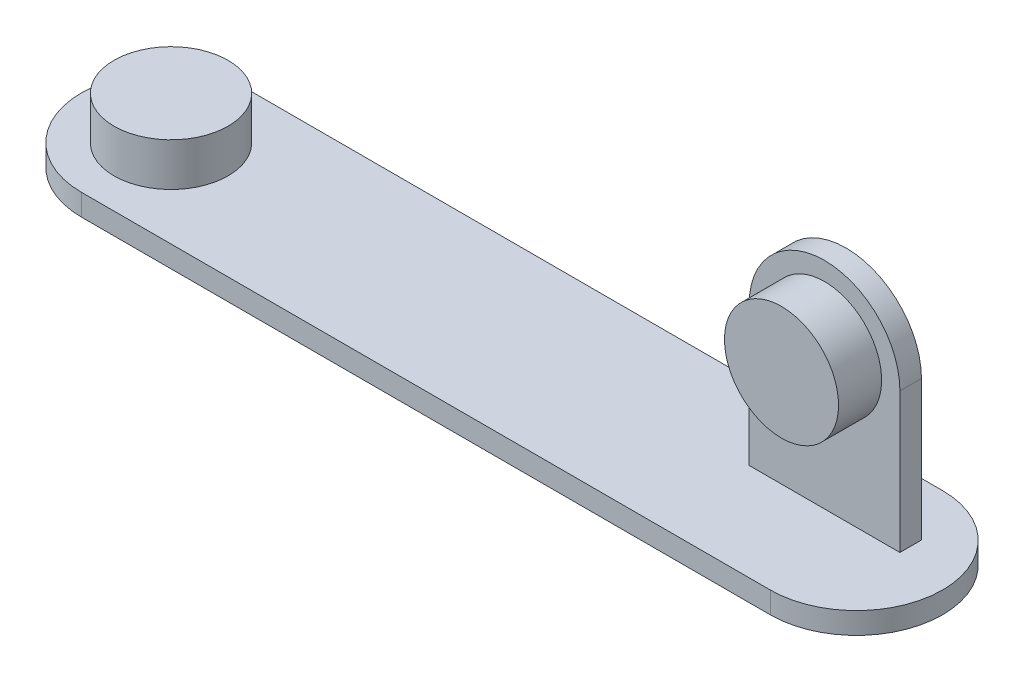
ISO-10303-21;
HEADER;
FILE_DESCRIPTION(('STEP AP214'),'2;1');
FILE_NAME('part.step','',(''),(''),'','','');
FILE_SCHEMA(('AUTOMOTIVE_DESIGN { 1 0 10303 214 1 1 1 1 }'));
ENDSEC;
DATA;
#1=APPLICATION_CONTEXT('core data for automotive mechanical design processes');
#2=APPLICATION_PROTOCOL_DEFINITION('international standard','automotive_design',2000,#1);
#3=PRODUCT_CONTEXT('',#1,'mechanical');
#4=PRODUCT('Part','Part','',(#3));
#5=PRODUCT_RELATED_PRODUCT_CATEGORY('part','',(#4));
#6=PRODUCT_DEFINITION_FORMATION('','',#4);
#7=PRODUCT_DEFINITION_CONTEXT('part definition',#1,'design');
#8=PRODUCT_DEFINITION('design','',#6,#7);
#9=PRODUCT_DEFINITION_SHAPE('','',#8);
#10=(LENGTH_UNIT() NAMED_UNIT(*) SI_UNIT(.MILLI.,.METRE.));
#11=(NAMED_UNIT(*) PLANE_ANGLE_UNIT() SI_UNIT($,.RADIAN.));
#12=(NAMED_UNIT(*) SI_UNIT($,.STERADIAN.) SOLID_ANGLE_UNIT());
#13=UNCERTAINTY_MEASURE_WITH_UNIT(LENGTH_MEASURE(1.E-05),#10,'distance_accuracy_value','');
#14=(GEOMETRIC_REPRESENTATION_CONTEXT(3) GLOBAL_UNCERTAINTY_ASSIGNED_CONTEXT((#13)) GLOBAL_UNIT_ASSIGNED_CONTEXT((#10,
#11,#12)) REPRESENTATION_CONTEXT('',''));
#15=CARTESIAN_POINT('',(0.,0.,0.));
#16=DIRECTION('',(0.,0.,1.));
#17=DIRECTION('',(1.,0.,0.));
#18=AXIS2_PLACEMENT_3D('',#15,#16,#17);
#19=CARTESIAN_POINT('',(-5.99999999999999,7.5,-5.51919935668366));
#20=DIRECTION('',(0.,0.,-1.));
#21=DIRECTION('',(-1.,0.,0.));
#22=AXIS2_PLACEMENT_3D('',#19,#20,#21);
#23=CYLINDRICAL_SURFACE('',#22,3.5);
#24=DIRECTION('',(0.,0.,1.));
#25=VECTOR('',#24,1.);
#26=CARTESIAN_POINT('',(-2.49999999999999,7.5,-5.51919935668366));
#27=LINE('',#26,#25);
#28=CARTESIAN_POINT('',(-2.49999999999999,7.5,-5.51919935668366));
#29=VERTEX_POINT('',#28);
#30=CARTESIAN_POINT('',(-2.49999999999999,7.5,-4.51919935668366));
#31=VERTEX_POINT('',#30);
#32=EDGE_CURVE('E167',#29,#31,#27,.T.);
#33=ORIENTED_EDGE('',*,*,#32,.F.);
#34=CARTESIAN_POINT('',(-5.99999999999999,7.5,-5.51919935668366));
#35=DIRECTION('',(0.,0.,1.));
#36=DIRECTION('',(1.,0.,0.));
#37=AXIS2_PLACEMENT_3D('',#34,#35,#36);
#38=CIRCLE('',#37,3.5);
#39=CARTESIAN_POINT('',(-9.49999999999999,7.5,-5.51919935668366));
#40=VERTEX_POINT('',#39);
#41=EDGE_CURVE('E50',#40,#29,#38,.F.);
#42=ORIENTED_EDGE('',*,*,#41,.F.);
#43=DIRECTION('',(0.,0.,1.));
#44=VECTOR('',#43,1.);
#45=CARTESIAN_POINT('',(-9.49999999999999,7.5,-5.51919935668366));
#46=LINE('',#45,#44);
#47=CARTESIAN_POINT('',(-9.49999999999999,7.5,-4.51919935668366));
#48=VERTEX_POINT('',#47);
#49=EDGE_CURVE('E170',#48,#40,#46,.F.);
#50=ORIENTED_EDGE('',*,*,#49,.F.);
#51=CARTESIAN_POINT('',(-5.99999999999999,7.5,-4.51919935668366));
#52=DIRECTION('',(0.,0.,-1.));
#53=DIRECTION('',(-1.,0.,0.));
#54=AXIS2_PLACEMENT_3D('',#51,#52,#53);
#55=CIRCLE('',#54,3.5);
#56=EDGE_CURVE('E43',#31,#48,#55,.F.);
#57=ORIENTED_EDGE('',*,*,#56,.F.);
#58=EDGE_LOOP('',(#33,#42,#50,#57));
#59=FACE_BOUND('',#58,.T.);
#60=ADVANCED_FACE('F35',(#59),#23,.T.);
#61=CARTESIAN_POINT('',(0.,1.,0.));
#62=DIRECTION('',(0.,1.,0.));
#63=DIRECTION('',(0.,0.,1.));
#64=AXIS2_PLACEMENT_3D('',#61,#62,#63);
#65=PLANE('',#64);
#66=CARTESIAN_POINT('',(-35.9030675856928,1.,-4.06518668938816));
#67=DIRECTION('',(0.,1.,0.));
#68=DIRECTION('',(0.,0.,1.));
#69=AXIS2_PLACEMENT_3D('',#66,#67,#68);
#70=CIRCLE('',#69,2.65);
#71=CARTESIAN_POINT('',(-35.9030675856928,1.,-1.41518668938816));
#72=VERTEX_POINT('',#71);
#73=EDGE_CURVE('E105',#72,#72,#70,.T.);
#74=ORIENTED_EDGE('',*,*,#73,.F.);
#75=EDGE_LOOP('',(#74));
#76=FACE_BOUND('',#75,.T.);
#77=DIRECTION('',(-1.,0.,0.));
#78=VECTOR('',#77,1.);
#79=CARTESIAN_POINT('',(-40.,1.,-8.));
#80=LINE('',#79,#78);
#81=CARTESIAN_POINT('',(-4.,1.,-8.00000000000001));
#82=VERTEX_POINT('',#81);
#83=CARTESIAN_POINT('',(-36.,1.,-8.));
#84=VERTEX_POINT('',#83);
#85=EDGE_CURVE('E139',#82,#84,#80,.T.);
#86=ORIENTED_EDGE('',*,*,#85,.T.);
#87=CARTESIAN_POINT('',(-36.,1.,-4.));
#88=DIRECTION('',(0.,1.,0.));
#89=DIRECTION('',(0.,0.,1.));
#90=AXIS2_PLACEMENT_3D('',#87,#88,#89);
#91=CIRCLE('',#90,4.);
#92=CARTESIAN_POINT('',(-36.,1.,0.));
#93=VERTEX_POINT('',#92);
#94=EDGE_CURVE('E165',#84,#93,#91,.T.);
#95=ORIENTED_EDGE('',*,*,#94,.T.);
#96=DIRECTION('',(1.,0.,0.));
#97=VECTOR('',#96,1.);
#98=CARTESIAN_POINT('',(-40.,1.,0.));
#99=LINE('',#98,#97);
#100=CARTESIAN_POINT('',(-4.,1.,0.));
#101=VERTEX_POINT('',#100);
#102=EDGE_CURVE('E137',#93,#101,#99,.T.);
#103=ORIENTED_EDGE('',*,*,#102,.T.);
#104=CARTESIAN_POINT('',(-4.,1.,-4.));
#105=DIRECTION('',(0.,1.,0.));
#106=DIRECTION('',(0.,0.,1.));
#107=AXIS2_PLACEMENT_3D('',#104,#105,#106);
#108=CIRCLE('',#107,4.);
#109=EDGE_CURVE('E155',#101,#82,#108,.T.);
#110=ORIENTED_EDGE('',*,*,#109,.T.);
#111=EDGE_LOOP('',(#86,#95,#103,#110));
#112=FACE_BOUND('',#111,.T.);
#113=DIRECTION('',(1.,0.,0.));
#114=VECTOR('',#113,1.);
#115=CARTESIAN_POINT('',(-9.49999999999999,1.,-4.51919935668366));
#116=LINE('',#115,#114);
#117=CARTESIAN_POINT('',(-9.49999999999999,1.,-4.51919935668366));
#118=VERTEX_POINT('',#117);
#119=CARTESIAN_POINT('',(-2.49999999999999,1.,-4.51919935668366));
#120=VERTEX_POINT('',#119);
#121=EDGE_CURVE('E102',#118,#120,#116,.T.);
#122=ORIENTED_EDGE('',*,*,#121,.F.);
#123=DIRECTION('',(0.,0.,1.));
#124=VECTOR('',#123,1.);
#125=CARTESIAN_POINT('',(-9.49999999999999,1.,-5.51919935668366));
#126=LINE('',#125,#124);
#127=CARTESIAN_POINT('',(-9.49999999999999,1.,-5.51919935668366));
#128=VERTEX_POINT('',#127);
#129=EDGE_CURVE('E109',#128,#118,#126,.T.);
#130=ORIENTED_EDGE('',*,*,#129,.F.);
#131=DIRECTION('',(-1.,0.,0.));
#132=VECTOR('',#131,1.);
#133=CARTESIAN_POINT('',(-9.49999999999999,1.,-5.51919935668366));
#134=LINE('',#133,#132);
#135=CARTESIAN_POINT('',(-2.49999999999999,1.,-5.51919935668366));
#136=VERTEX_POINT('',#135);
#137=EDGE_CURVE('E122',#136,#128,#134,.T.);
#138=ORIENTED_EDGE('',*,*,#137,.F.);
#139=DIRECTION('',(0.,0.,-1.));
#140=VECTOR('',#139,1.);
#141=CARTESIAN_POINT('',(-2.49999999999999,1.,-5.51919935668366));
#142=LINE('',#141,#140);
#143=EDGE_CURVE('E120',#120,#136,#142,.T.);
#144=ORIENTED_EDGE('',*,*,#143,.F.);
#145=EDGE_LOOP('',(#122,#130,#138,#144));
#146=FACE_BOUND('',#145,.T.);
#147=ADVANCED_FACE('F118',(#76,#112,#146),#65,.T.);
#148=CARTESIAN_POINT('',(-36.,0.,-4.));
#149=DIRECTION('',(0.,-1.,0.));
#150=DIRECTION('',(0.,0.,-1.));
#151=AXIS2_PLACEMENT_3D('',#148,#149,#150);
#152=CYLINDRICAL_SURFACE('',#151,4.);
#153=DIRECTION('',(0.,-1.,0.));
#154=VECTOR('',#153,1.);
#155=CARTESIAN_POINT('',(-36.,1.,-8.));
#156=LINE('',#155,#154);
#157=CARTESIAN_POINT('',(-36.,0.,-8.));
#158=VERTEX_POINT('',#157);
#159=EDGE_CURVE('E157',#158,#84,#156,.F.);
#160=ORIENTED_EDGE('',*,*,#159,.F.);
#161=CARTESIAN_POINT('',(-36.,0.,-4.));
#162=DIRECTION('',(0.,1.,0.));
#163=DIRECTION('',(0.,0.,1.));
#164=AXIS2_PLACEMENT_3D('',#161,#162,#163);
#165=CIRCLE('',#164,4.);
#166=CARTESIAN_POINT('',(-36.,0.,0.));
#167=VERTEX_POINT('',#166);
#168=EDGE_CURVE('E163',#167,#158,#165,.F.);
#169=ORIENTED_EDGE('',*,*,#168,.F.);
#170=DIRECTION('',(0.,-1.,0.));
#171=VECTOR('',#170,1.);
#172=CARTESIAN_POINT('',(-36.,1.,0.));
#173=LINE('',#172,#171);
#174=EDGE_CURVE('E160',#93,#167,#173,.T.);
#175=ORIENTED_EDGE('',*,*,#174,.F.);
#176=ORIENTED_EDGE('',*,*,#94,.F.);
#177=EDGE_LOOP('',(#160,#169,#175,#176));
#178=FACE_BOUND('',#177,.T.);
#179=ADVANCED_FACE('F191',(#178),#152,.T.);
#180=CARTESIAN_POINT('',(-4.,0.,-4.));
#181=DIRECTION('',(0.,-1.,0.));
#182=DIRECTION('',(0.,0.,-1.));
#183=AXIS2_PLACEMENT_3D('',#180,#181,#182);
#184=CYLINDRICAL_SURFACE('',#183,4.);
#185=DIRECTION('',(0.,-1.,0.));
#186=VECTOR('',#185,1.);
#187=CARTESIAN_POINT('',(-4.,1.,0.));
#188=LINE('',#187,#186);
#189=CARTESIAN_POINT('',(-4.,0.,0.));
#190=VERTEX_POINT('',#189);
#191=EDGE_CURVE('E143',#190,#101,#188,.F.);
#192=ORIENTED_EDGE('',*,*,#191,.F.);
#193=CARTESIAN_POINT('',(-4.,0.,-4.));
#194=DIRECTION('',(0.,1.,0.));
#195=DIRECTION('',(0.,0.,1.));
#196=AXIS2_PLACEMENT_3D('',#193,#194,#195);
#197=CIRCLE('',#196,4.);
#198=CARTESIAN_POINT('',(-4.,0.,-8.00000000000001));
#199=VERTEX_POINT('',#198);
#200=EDGE_CURVE('E152',#199,#190,#197,.F.);
#201=ORIENTED_EDGE('',*,*,#200,.F.);
#202=DIRECTION('',(0.,-1.,0.));
#203=VECTOR('',#202,1.);
#204=CARTESIAN_POINT('',(-4.,1.,-8.00000000000001));
#205=LINE('',#204,#203);
#206=EDGE_CURVE('E149',#82,#199,#205,.T.);
#207=ORIENTED_EDGE('',*,*,#206,.F.);
#208=ORIENTED_EDGE('',*,*,#109,.F.);
#209=EDGE_LOOP('',(#192,#201,#207,#208));
#210=FACE_BOUND('',#209,.T.);
#211=ADVANCED_FACE('F197',(#210),#184,.T.);
#212=CARTESIAN_POINT('',(-40.,1.,0.));
#213=DIRECTION('',(0.,0.,-1.));
#214=DIRECTION('',(-1.,0.,0.));
#215=AXIS2_PLACEMENT_3D('',#212,#213,#214);
#216=PLANE('',#215);
#217=ORIENTED_EDGE('',*,*,#102,.F.);
#218=ORIENTED_EDGE('',*,*,#174,.T.);
#219=DIRECTION('',(1.,0.,0.));
#220=VECTOR('',#219,1.);
#221=CARTESIAN_POINT('',(-40.,0.,0.));
#222=LINE('',#221,#220);
#223=EDGE_CURVE('E134',#167,#190,#222,.T.);
#224=ORIENTED_EDGE('',*,*,#223,.T.);
#225=ORIENTED_EDGE('',*,*,#191,.T.);
#226=EDGE_LOOP('',(#217,#218,#224,#225));
#227=FACE_BOUND('',#226,.T.);
#228=ADVANCED_FACE('F212',(#227),#216,.F.);
#229=CARTESIAN_POINT('',(-40.,1.,-8.));
#230=DIRECTION('',(0.,0.,1.));
#231=DIRECTION('',(1.,0.,0.));
#232=AXIS2_PLACEMENT_3D('',#229,#230,#231);
#233=PLANE('',#232);
#234=DIRECTION('',(-1.,0.,0.));
#235=VECTOR('',#234,1.);
#236=CARTESIAN_POINT('',(-40.,0.,-8.));
#237=LINE('',#236,#235);
#238=EDGE_CURVE('E140',#199,#158,#237,.T.);
#239=ORIENTED_EDGE('',*,*,#238,.T.);
#240=ORIENTED_EDGE('',*,*,#159,.T.);
#241=ORIENTED_EDGE('',*,*,#85,.F.);
#242=ORIENTED_EDGE('',*,*,#206,.T.);
#243=EDGE_LOOP('',(#239,#240,#241,#242));
#244=FACE_BOUND('',#243,.T.);
#245=ADVANCED_FACE('F208',(#244),#233,.F.);
#246=CARTESIAN_POINT('',(0.,0.,0.));
#247=DIRECTION('',(0.,1.,0.));
#248=DIRECTION('',(0.,0.,1.));
#249=AXIS2_PLACEMENT_3D('',#246,#247,#248);
#250=PLANE('',#249);
#251=ORIENTED_EDGE('',*,*,#223,.F.);
#252=ORIENTED_EDGE('',*,*,#168,.T.);
#253=ORIENTED_EDGE('',*,*,#238,.F.);
#254=ORIENTED_EDGE('',*,*,#200,.T.);
#255=EDGE_LOOP('',(#251,#252,#253,#254));
#256=FACE_BOUND('',#255,.T.);
#257=ADVANCED_FACE('F205',(#256),#250,.F.);
#258=CARTESIAN_POINT('',(-35.9030675856928,3.,-4.06518668938816));
#259=DIRECTION('',(0.,-1.,0.));
#260=DIRECTION('',(0.,0.,-1.));
#261=AXIS2_PLACEMENT_3D('',#258,#259,#260);
#262=CYLINDRICAL_SURFACE('',#261,2.65);
#263=CARTESIAN_POINT('',(-35.9030675856928,3.,-4.06518668938816));
#264=DIRECTION('',(0.,1.,0.));
#265=DIRECTION('',(0.,0.,1.));
#266=AXIS2_PLACEMENT_3D('',#263,#264,#265);
#267=CIRCLE('',#266,2.65);
#268=CARTESIAN_POINT('',(-35.9030675856928,3.,-1.41518668938816));
#269=VERTEX_POINT('',#268);
#270=EDGE_CURVE('E131',#269,#269,#267,.T.);
#271=ORIENTED_EDGE('',*,*,#270,.F.);
#272=EDGE_LOOP('',(#271));
#273=FACE_BOUND('',#272,.T.);
#274=ORIENTED_EDGE('',*,*,#73,.T.);
#275=EDGE_LOOP('',(#274));
#276=FACE_BOUND('',#275,.T.);
#277=ADVANCED_FACE('F203',(#273,#276),#262,.T.);
#278=CARTESIAN_POINT('',(-35.9030675856928,3.,-4.06518668938816));
#279=DIRECTION('',(0.,1.,0.));
#280=DIRECTION('',(0.,0.,1.));
#281=AXIS2_PLACEMENT_3D('',#278,#279,#280);
#282=PLANE('',#281);
#283=ORIENTED_EDGE('',*,*,#270,.T.);
#284=EDGE_LOOP('',(#283));
#285=FACE_BOUND('',#284,.T.);
#286=ADVANCED_FACE('F258',(#285),#282,.T.);
#287=CARTESIAN_POINT('',(-9.49999999999999,11.,-5.51919935668366));
#288=DIRECTION('',(1.,0.,0.));
#289=DIRECTION('',(0.,0.,-1.));
#290=AXIS2_PLACEMENT_3D('',#287,#288,#289);
#291=PLANE('',#290);
#292=DIRECTION('',(0.,-1.,0.));
#293=VECTOR('',#292,1.);
#294=CARTESIAN_POINT('',(-9.49999999999999,11.,-4.51919935668366));
#295=LINE('',#294,#293);
#296=EDGE_CURVE('E98',#48,#118,#295,.T.);
#297=ORIENTED_EDGE('',*,*,#296,.F.);
#298=ORIENTED_EDGE('',*,*,#49,.T.);
#299=DIRECTION('',(0.,-1.,0.));
#300=VECTOR('',#299,1.);
#301=CARTESIAN_POINT('',(-9.49999999999999,11.,-5.51919935668366));
#302=LINE('',#301,#300);
#303=EDGE_CURVE('E112',#40,#128,#302,.T.);
#304=ORIENTED_EDGE('',*,*,#303,.T.);
#305=ORIENTED_EDGE('',*,*,#129,.T.);
#306=EDGE_LOOP('',(#297,#298,#304,#305));
#307=FACE_BOUND('',#306,.T.);
#308=ADVANCED_FACE('F110',(#307),#291,.F.);
#309=CARTESIAN_POINT('',(-9.49999999999999,11.,-4.51919935668366));
#310=DIRECTION('',(0.,0.,-1.));
#311=DIRECTION('',(-1.,0.,0.));
#312=AXIS2_PLACEMENT_3D('',#309,#310,#311);
#313=PLANE('',#312);
#314=CARTESIAN_POINT('',(-5.99999999999999,7.5,-4.51919935668366));
#315=DIRECTION('',(0.,0.,-1.));
#316=DIRECTION('',(-1.,0.,0.));
#317=AXIS2_PLACEMENT_3D('',#314,#315,#316);
#318=CIRCLE('',#317,2.65);
#319=CARTESIAN_POINT('',(-8.65,7.5,-4.51919935668366));
#320=VERTEX_POINT('',#319);
#321=EDGE_CURVE('E11',#320,#320,#318,.F.);
#322=ORIENTED_EDGE('',*,*,#321,.F.);
#323=EDGE_LOOP('',(#322));
#324=FACE_BOUND('',#323,.T.);
#325=DIRECTION('',(0.,-1.,0.));
#326=VECTOR('',#325,1.);
#327=CARTESIAN_POINT('',(-2.49999999999999,11.,-4.51919935668366));
#328=LINE('',#327,#326);
#329=EDGE_CURVE('E106',#31,#120,#328,.T.);
#330=ORIENTED_EDGE('',*,*,#329,.F.);
#331=ORIENTED_EDGE('',*,*,#56,.T.);
#332=ORIENTED_EDGE('',*,*,#296,.T.);
#333=ORIENTED_EDGE('',*,*,#121,.T.);
#334=EDGE_LOOP('',(#330,#331,#332,#333));
#335=FACE_BOUND('',#334,.T.);
#336=ADVANCED_FACE('F100',(#324,#335),#313,.F.);
#337=CARTESIAN_POINT('',(-2.49999999999999,11.,-5.51919935668366));
#338=DIRECTION('',(-1.,0.,0.));
#339=DIRECTION('',(0.,0.,1.));
#340=AXIS2_PLACEMENT_3D('',#337,#338,#339);
#341=PLANE('',#340);
#342=DIRECTION('',(0.,-1.,0.));
#343=VECTOR('',#342,1.);
#344=CARTESIAN_POINT('',(-2.49999999999999,11.,-5.51919935668366));
#345=LINE('',#344,#343);
#346=EDGE_CURVE('E128',#29,#136,#345,.T.);
#347=ORIENTED_EDGE('',*,*,#346,.F.);
#348=ORIENTED_EDGE('',*,*,#32,.T.);
#349=ORIENTED_EDGE('',*,*,#329,.T.);
#350=ORIENTED_EDGE('',*,*,#143,.T.);
#351=EDGE_LOOP('',(#347,#348,#349,#350));
#352=FACE_BOUND('',#351,.T.);
#353=ADVANCED_FACE('F176',(#352),#341,.F.);
#354=CARTESIAN_POINT('',(-9.49999999999999,11.,-5.51919935668366));
#355=DIRECTION('',(0.,0.,1.));
#356=DIRECTION('',(1.,0.,0.));
#357=AXIS2_PLACEMENT_3D('',#354,#355,#356);
#358=PLANE('',#357);
#359=ORIENTED_EDGE('',*,*,#303,.F.);
#360=ORIENTED_EDGE('',*,*,#41,.T.);
#361=ORIENTED_EDGE('',*,*,#346,.T.);
#362=ORIENTED_EDGE('',*,*,#137,.T.);
#363=EDGE_LOOP('',(#359,#360,#361,#362));
#364=FACE_BOUND('',#363,.T.);
#365=ADVANCED_FACE('F173',(#364),#358,.F.);
#366=CARTESIAN_POINT('',(-5.99999999999999,7.5,-2.51919935668366));
#367=DIRECTION('',(0.,0.,-1.));
#368=DIRECTION('',(-1.,0.,0.));
#369=AXIS2_PLACEMENT_3D('',#366,#367,#368);
#370=CYLINDRICAL_SURFACE('',#369,2.65);
#371=CARTESIAN_POINT('',(-5.99999999999999,7.5,-2.51919935668366));
#372=DIRECTION('',(0.,0.,1.));
#373=DIRECTION('',(1.,0.,0.));
#374=AXIS2_PLACEMENT_3D('',#371,#372,#373);
#375=CIRCLE('',#374,2.65);
#376=CARTESIAN_POINT('',(-3.34999999999999,7.5,-2.51919935668366));
#377=VERTEX_POINT('',#376);
#378=EDGE_CURVE('E116',#377,#377,#375,.T.);
#379=ORIENTED_EDGE('',*,*,#378,.F.);
#380=EDGE_LOOP('',(#379));
#381=FACE_BOUND('',#380,.T.);
#382=ORIENTED_EDGE('',*,*,#321,.T.);
#383=EDGE_LOOP('',(#382));
#384=FACE_BOUND('',#383,.T.);
#385=ADVANCED_FACE('F183',(#381,#384),#370,.T.);
#386=CARTESIAN_POINT('',(-5.99999999999999,7.5,-2.51919935668366));
#387=DIRECTION('',(0.,0.,1.));
#388=DIRECTION('',(1.,0.,0.));
#389=AXIS2_PLACEMENT_3D('',#386,#387,#388);
#390=PLANE('',#389);
#391=ORIENTED_EDGE('',*,*,#378,.T.);
#392=EDGE_LOOP('',(#391));
#393=FACE_BOUND('',#392,.T.);
#394=ADVANCED_FACE('F288',(#393),#390,.T.);
#395=CLOSED_SHELL('',(#60,#147,#179,#211,#228,#245,#257,#277,#286,#308,#336,#353,#365,#385,#394));
#396=MANIFOLD_SOLID_BREP('B2',#395);
#397=ADVANCED_BREP_SHAPE_REPRESENTATION('',(#18,#396),#14);
#398=SHAPE_DEFINITION_REPRESENTATION(#9,#397);
ENDSEC;
END-ISO-10303-21;
